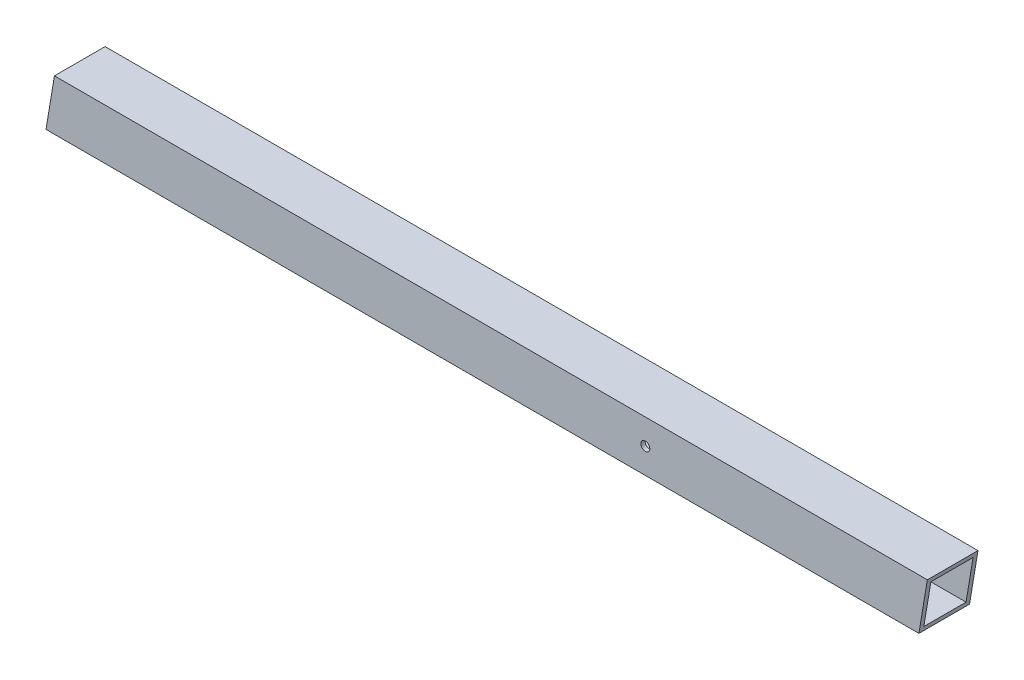
ISO-10303-21;
HEADER;
FILE_DESCRIPTION(('STEP AP214'),'2;1');
FILE_NAME('part.step','',(''),(''),'','','');
FILE_SCHEMA(('AUTOMOTIVE_DESIGN { 1 0 10303 214 1 1 1 1 }'));
ENDSEC;
DATA;
#1=APPLICATION_CONTEXT('core data for automotive mechanical design processes');
#2=APPLICATION_PROTOCOL_DEFINITION('international standard','automotive_design',2000,#1);
#3=PRODUCT_CONTEXT('',#1,'mechanical');
#4=PRODUCT('Part','Part','',(#3));
#5=PRODUCT_RELATED_PRODUCT_CATEGORY('part','',(#4));
#6=PRODUCT_DEFINITION_FORMATION('','',#4);
#7=PRODUCT_DEFINITION_CONTEXT('part definition',#1,'design');
#8=PRODUCT_DEFINITION('design','',#6,#7);
#9=PRODUCT_DEFINITION_SHAPE('','',#8);
#10=(LENGTH_UNIT() NAMED_UNIT(*) SI_UNIT(.MILLI.,.METRE.));
#11=(NAMED_UNIT(*) PLANE_ANGLE_UNIT() SI_UNIT($,.RADIAN.));
#12=(NAMED_UNIT(*) SI_UNIT($,.STERADIAN.) SOLID_ANGLE_UNIT());
#13=UNCERTAINTY_MEASURE_WITH_UNIT(LENGTH_MEASURE(1.E-05),#10,'distance_accuracy_value','');
#14=(GEOMETRIC_REPRESENTATION_CONTEXT(3) GLOBAL_UNCERTAINTY_ASSIGNED_CONTEXT((#13)) GLOBAL_UNIT_ASSIGNED_CONTEXT((#10,
#11,#12)) REPRESENTATION_CONTEXT('',''));
#15=CARTESIAN_POINT('',(0.,0.,0.));
#16=DIRECTION('',(0.,0.,1.));
#17=DIRECTION('',(1.,0.,0.));
#18=AXIS2_PLACEMENT_3D('',#15,#16,#17);
#19=CARTESIAN_POINT('',(6.26360141633399,38.0999999999999,-38.1));
#20=DIRECTION('',(0.,-1.,0.));
#21=DIRECTION('',(1.,0.,0.));
#22=AXIS2_PLACEMENT_3D('',#19,#20,#21);
#23=PLANE('',#22);
#24=DIRECTION('',(0.,0.,1.));
#25=VECTOR('',#24,1.);
#26=CARTESIAN_POINT('',(-32.3619406510596,38.0999999999999,-38.1));
#27=LINE('',#26,#25);
#28=CARTESIAN_POINT('',(-32.3619406510596,38.0999999999999,-38.1));
#29=VERTEX_POINT('',#28);
#30=CARTESIAN_POINT('',(-32.3619406510596,38.0999999999999,0.));
#31=VERTEX_POINT('',#30);
#32=EDGE_CURVE('E99',#29,#31,#27,.T.);
#33=ORIENTED_EDGE('',*,*,#32,.F.);
#34=DIRECTION('',(-1.,0.,0.));
#35=VECTOR('',#34,1.);
#36=CARTESIAN_POINT('',(6.26360141633399,38.0999999999999,-38.1));
#37=LINE('',#36,#35);
#38=CARTESIAN_POINT('',(-688.996155796752,38.1,-38.1));
#39=VERTEX_POINT('',#38);
#40=EDGE_CURVE('E122',#29,#39,#37,.T.);
#41=ORIENTED_EDGE('',*,*,#40,.T.);
#42=DIRECTION('',(0.,0.,-1.));
#43=VECTOR('',#42,1.);
#44=CARTESIAN_POINT('',(-688.996155796752,38.1,-38.1));
#45=LINE('',#44,#43);
#46=CARTESIAN_POINT('',(-688.996155796752,38.1,0.));
#47=VERTEX_POINT('',#46);
#48=EDGE_CURVE('E141',#47,#39,#45,.T.);
#49=ORIENTED_EDGE('',*,*,#48,.F.);
#50=DIRECTION('',(-1.,0.,0.));
#51=VECTOR('',#50,1.);
#52=CARTESIAN_POINT('',(6.26360141633399,38.0999999999999,0.));
#53=LINE('',#52,#51);
#54=EDGE_CURVE('E118',#31,#47,#53,.T.);
#55=ORIENTED_EDGE('',*,*,#54,.F.);
#56=EDGE_LOOP('',(#33,#41,#49,#55));
#57=FACE_BOUND('',#56,.T.);
#58=ADVANCED_FACE('F33',(#57),#23,.F.);
#59=CARTESIAN_POINT('',(6.26360141633409,0.,0.));
#60=DIRECTION('',(0.,0.,-1.));
#61=DIRECTION('',(-0.986393923832144,0.164398987305357,0.));
#62=AXIS2_PLACEMENT_3D('',#59,#60,#61);
#63=PLANE('',#62);
#64=CARTESIAN_POINT('',(-244.496155796752,19.0499999999999,0.));
#65=DIRECTION('',(0.,0.,1.));
#66=DIRECTION('',(0.986393923832144,-0.164398987305357,0.));
#67=AXIS2_PLACEMENT_3D('',#64,#65,#66);
#68=CIRCLE('',#67,3.3782);
#69=CARTESIAN_POINT('',(-241.163919843263,18.4946273410849,0.));
#70=VERTEX_POINT('',#69);
#71=EDGE_CURVE('E191',#70,#70,#68,.T.);
#72=ORIENTED_EDGE('',*,*,#71,.F.);
#73=EDGE_LOOP('',(#72));
#74=FACE_BOUND('',#73,.T.);
#75=DIRECTION('',(0.164398987305357,0.986393923832144,0.));
#76=VECTOR('',#75,1.);
#77=CARTESIAN_POINT('',(-149.28250042263,-663.423358629421,0.));
#78=LINE('',#77,#76);
#79=CARTESIAN_POINT('',(-38.7119406510596,-1.11022302462516E-13,0.));
#80=VERTEX_POINT('',#79);
#81=EDGE_CURVE('E95',#80,#31,#78,.T.);
#82=ORIENTED_EDGE('',*,*,#81,.T.);
#83=ORIENTED_EDGE('',*,*,#54,.T.);
#84=DIRECTION('',(-0.164398987305357,-0.986393923832144,0.));
#85=VECTOR('',#84,1.);
#86=CARTESIAN_POINT('',(-690.040089366142,31.8363985836658,0.));
#87=LINE('',#86,#85);
#88=CARTESIAN_POINT('',(-695.346155796752,0.,0.));
#89=VERTEX_POINT('',#88);
#90=EDGE_CURVE('E117',#47,#89,#87,.T.);
#91=ORIENTED_EDGE('',*,*,#90,.T.);
#92=DIRECTION('',(-1.,0.,0.));
#93=VECTOR('',#92,1.);
#94=CARTESIAN_POINT('',(6.26360141633409,0.,0.));
#95=LINE('',#94,#93);
#96=EDGE_CURVE('E109',#80,#89,#95,.T.);
#97=ORIENTED_EDGE('',*,*,#96,.F.);
#98=EDGE_LOOP('',(#82,#83,#91,#97));
#99=FACE_BOUND('',#98,.T.);
#100=ADVANCED_FACE('F115',(#74,#99),#63,.F.);
#101=CARTESIAN_POINT('',(6.26360141633409,0.,-38.1));
#102=DIRECTION('',(0.,1.,0.));
#103=DIRECTION('',(-1.,0.,0.));
#104=AXIS2_PLACEMENT_3D('',#101,#102,#103);
#105=PLANE('',#104);
#106=DIRECTION('',(0.,0.,-1.));
#107=VECTOR('',#106,1.);
#108=CARTESIAN_POINT('',(-38.7119406510596,-1.11022302462516E-13,-38.1));
#109=LINE('',#108,#107);
#110=CARTESIAN_POINT('',(-38.7119406510596,-1.11022302462516E-13,-38.1));
#111=VERTEX_POINT('',#110);
#112=EDGE_CURVE('E98',#80,#111,#109,.T.);
#113=ORIENTED_EDGE('',*,*,#112,.F.);
#114=ORIENTED_EDGE('',*,*,#96,.T.);
#115=DIRECTION('',(0.,0.,1.));
#116=VECTOR('',#115,1.);
#117=CARTESIAN_POINT('',(-695.346155796752,0.,-38.1));
#118=LINE('',#117,#116);
#119=CARTESIAN_POINT('',(-695.346155796752,0.,-38.1));
#120=VERTEX_POINT('',#119);
#121=EDGE_CURVE('E146',#120,#89,#118,.T.);
#122=ORIENTED_EDGE('',*,*,#121,.F.);
#123=DIRECTION('',(-1.,0.,0.));
#124=VECTOR('',#123,1.);
#125=CARTESIAN_POINT('',(6.26360141633409,0.,-38.1));
#126=LINE('',#125,#124);
#127=EDGE_CURVE('E111',#111,#120,#126,.T.);
#128=ORIENTED_EDGE('',*,*,#127,.F.);
#129=EDGE_LOOP('',(#113,#114,#122,#128));
#130=FACE_BOUND('',#129,.T.);
#131=ADVANCED_FACE('F107',(#130),#105,.F.);
#132=CARTESIAN_POINT('',(6.26360141633409,0.,-38.1));
#133=DIRECTION('',(0.,0.,1.));
#134=DIRECTION('',(0.986393923832144,-0.164398987305357,0.));
#135=AXIS2_PLACEMENT_3D('',#132,#133,#134);
#136=PLANE('',#135);
#137=CARTESIAN_POINT('',(-244.496155796752,19.0499999999999,-38.1));
#138=DIRECTION('',(0.,0.,1.));
#139=DIRECTION('',(0.986393923832144,-0.164398987305357,0.));
#140=AXIS2_PLACEMENT_3D('',#137,#138,#139);
#141=CIRCLE('',#140,3.3782);
#142=CARTESIAN_POINT('',(-241.163919843263,18.4946273410849,-38.1));
#143=VERTEX_POINT('',#142);
#144=EDGE_CURVE('E188',#143,#143,#141,.T.);
#145=ORIENTED_EDGE('',*,*,#144,.T.);
#146=EDGE_LOOP('',(#145));
#147=FACE_BOUND('',#146,.T.);
#148=DIRECTION('',(0.164398987305357,0.986393923832144,0.));
#149=VECTOR('',#148,1.);
#150=CARTESIAN_POINT('',(-149.28250042263,-663.423358629421,-38.1));
#151=LINE('',#150,#149);
#152=EDGE_CURVE('E48',#111,#29,#151,.T.);
#153=ORIENTED_EDGE('',*,*,#152,.F.);
#154=ORIENTED_EDGE('',*,*,#127,.T.);
#155=DIRECTION('',(-0.164398987305357,-0.986393923832144,0.));
#156=VECTOR('',#155,1.);
#157=CARTESIAN_POINT('',(-690.040089366142,31.8363985836658,-38.1));
#158=LINE('',#157,#156);
#159=EDGE_CURVE('E112',#39,#120,#158,.T.);
#160=ORIENTED_EDGE('',*,*,#159,.F.);
#161=ORIENTED_EDGE('',*,*,#40,.F.);
#162=EDGE_LOOP('',(#153,#154,#160,#161));
#163=FACE_BOUND('',#162,.T.);
#164=ADVANCED_FACE('F183',(#147,#163),#136,.F.);
#165=CARTESIAN_POINT('',(-690.040089366142,31.8363985836658,-38.1));
#166=DIRECTION('',(-0.986393923832144,0.164398987305357,0.));
#167=DIRECTION('',(0.,0.,1.));
#168=AXIS2_PLACEMENT_3D('',#165,#166,#167);
#169=PLANE('',#168);
#170=DIRECTION('',(0.164398987305357,0.986393923832144,0.));
#171=VECTOR('',#170,1.);
#172=CARTESIAN_POINT('',(-675.868865061264,116.863744412933,-3.175));
#173=LINE('',#172,#171);
#174=CARTESIAN_POINT('',(-694.816989130086,3.17499999999993,-3.17499999999999));
#175=VERTEX_POINT('',#174);
#176=CARTESIAN_POINT('',(-689.525322463419,34.9250000000001,-3.17499999999999));
#177=VERTEX_POINT('',#176);
#178=EDGE_CURVE('E41',#175,#177,#173,.T.);
#179=ORIENTED_EDGE('',*,*,#178,.F.);
#180=DIRECTION('',(0.,0.,1.));
#181=VECTOR('',#180,1.);
#182=CARTESIAN_POINT('',(-694.816989130086,3.17499999999993,-34.925));
#183=LINE('',#182,#181);
#184=CARTESIAN_POINT('',(-694.816989130086,3.17499999999993,-34.925));
#185=VERTEX_POINT('',#184);
#186=EDGE_CURVE('E164',#185,#175,#183,.T.);
#187=ORIENTED_EDGE('',*,*,#186,.F.);
#188=DIRECTION('',(-0.164398987305357,-0.986393923832144,0.));
#189=VECTOR('',#188,1.);
#190=CARTESIAN_POINT('',(-675.868865061264,116.863744412933,-34.925));
#191=LINE('',#190,#189);
#192=CARTESIAN_POINT('',(-689.525322463419,34.9250000000001,-34.925));
#193=VERTEX_POINT('',#192);
#194=EDGE_CURVE('E168',#193,#185,#191,.T.);
#195=ORIENTED_EDGE('',*,*,#194,.F.);
#196=DIRECTION('',(0.,0.,-1.));
#197=VECTOR('',#196,1.);
#198=CARTESIAN_POINT('',(-689.525322463419,34.9250000000001,-34.925));
#199=LINE('',#198,#197);
#200=EDGE_CURVE('E151',#177,#193,#199,.T.);
#201=ORIENTED_EDGE('',*,*,#200,.F.);
#202=EDGE_LOOP('',(#179,#187,#195,#201));
#203=FACE_BOUND('',#202,.T.);
#204=ORIENTED_EDGE('',*,*,#48,.T.);
#205=ORIENTED_EDGE('',*,*,#159,.T.);
#206=ORIENTED_EDGE('',*,*,#121,.T.);
#207=ORIENTED_EDGE('',*,*,#90,.F.);
#208=EDGE_LOOP('',(#204,#205,#206,#207));
#209=FACE_BOUND('',#208,.T.);
#210=ADVANCED_FACE('F163',(#203,#209),#169,.T.);
#211=CARTESIAN_POINT('',(6.26360141633402,34.9249999999999,-34.925));
#212=DIRECTION('',(0.,-1.,0.));
#213=DIRECTION('',(1.,0.,0.));
#214=AXIS2_PLACEMENT_3D('',#211,#212,#213);
#215=PLANE('',#214);
#216=DIRECTION('',(-1.,0.,0.));
#217=VECTOR('',#216,1.);
#218=CARTESIAN_POINT('',(6.26360141633402,34.9249999999999,-34.925));
#219=LINE('',#218,#217);
#220=CARTESIAN_POINT('',(-32.8911073177263,34.925,-34.925));
#221=VERTEX_POINT('',#220);
#222=EDGE_CURVE('E127',#221,#193,#219,.T.);
#223=ORIENTED_EDGE('',*,*,#222,.F.);
#224=DIRECTION('',(0.,0.,1.));
#225=VECTOR('',#224,1.);
#226=CARTESIAN_POINT('',(-32.8911073177263,34.925,-34.925));
#227=LINE('',#226,#225);
#228=CARTESIAN_POINT('',(-32.8911073177263,34.925,-3.175));
#229=VERTEX_POINT('',#228);
#230=EDGE_CURVE('E11',#221,#229,#227,.T.);
#231=ORIENTED_EDGE('',*,*,#230,.T.);
#232=DIRECTION('',(-1.,0.,0.));
#233=VECTOR('',#232,1.);
#234=CARTESIAN_POINT('',(6.26360141633402,34.9249999999999,-3.175));
#235=LINE('',#234,#233);
#236=EDGE_CURVE('E120',#229,#177,#235,.T.);
#237=ORIENTED_EDGE('',*,*,#236,.T.);
#238=ORIENTED_EDGE('',*,*,#200,.T.);
#239=EDGE_LOOP('',(#223,#231,#237,#238));
#240=FACE_BOUND('',#239,.T.);
#241=ADVANCED_FACE('F174',(#240),#215,.T.);
#242=CARTESIAN_POINT('',(6.26360141633407,3.17500000000004,-34.925));
#243=DIRECTION('',(0.,0.,1.));
#244=DIRECTION('',(0.986393923832144,-0.164398987305357,0.));
#245=AXIS2_PLACEMENT_3D('',#242,#243,#244);
#246=PLANE('',#245);
#247=CARTESIAN_POINT('',(-244.496155796752,19.0499999999999,-34.925));
#248=DIRECTION('',(0.,0.,1.));
#249=DIRECTION('',(0.986393923832144,-0.164398987305357,0.));
#250=AXIS2_PLACEMENT_3D('',#247,#248,#249);
#251=CIRCLE('',#250,3.3782);
#252=CARTESIAN_POINT('',(-241.163919843263,18.4946273410849,-34.925));
#253=VERTEX_POINT('',#252);
#254=EDGE_CURVE('E184',#253,#253,#251,.T.);
#255=ORIENTED_EDGE('',*,*,#254,.F.);
#256=EDGE_LOOP('',(#255));
#257=FACE_BOUND('',#256,.T.);
#258=DIRECTION('',(-1.,0.,0.));
#259=VECTOR('',#258,1.);
#260=CARTESIAN_POINT('',(6.26360141633407,3.17500000000004,-34.925));
#261=LINE('',#260,#259);
#262=CARTESIAN_POINT('',(-38.1827739843929,3.17499999999993,-34.925));
#263=VERTEX_POINT('',#262);
#264=EDGE_CURVE('E131',#263,#185,#261,.T.);
#265=ORIENTED_EDGE('',*,*,#264,.F.);
#266=DIRECTION('',(0.164398987305357,0.986393923832144,0.));
#267=VECTOR('',#266,1.);
#268=CARTESIAN_POINT('',(-36.9815205951841,10.382520335253,-34.925));
#269=LINE('',#268,#267);
#270=EDGE_CURVE('E103',#263,#221,#269,.T.);
#271=ORIENTED_EDGE('',*,*,#270,.T.);
#272=ORIENTED_EDGE('',*,*,#222,.T.);
#273=ORIENTED_EDGE('',*,*,#194,.T.);
#274=EDGE_LOOP('',(#265,#271,#272,#273));
#275=FACE_BOUND('',#274,.T.);
#276=ADVANCED_FACE('F175',(#257,#275),#246,.T.);
#277=CARTESIAN_POINT('',(6.26360141633407,3.17500000000004,-34.925));
#278=DIRECTION('',(0.,1.,0.));
#279=DIRECTION('',(-1.,0.,0.));
#280=AXIS2_PLACEMENT_3D('',#277,#278,#279);
#281=PLANE('',#280);
#282=DIRECTION('',(-1.,0.,0.));
#283=VECTOR('',#282,1.);
#284=CARTESIAN_POINT('',(6.26360141633407,3.17500000000004,-3.175));
#285=LINE('',#284,#283);
#286=CARTESIAN_POINT('',(-38.1827739843929,3.17499999999993,-3.17499999999999));
#287=VERTEX_POINT('',#286);
#288=EDGE_CURVE('E138',#287,#175,#285,.T.);
#289=ORIENTED_EDGE('',*,*,#288,.F.);
#290=DIRECTION('',(0.,0.,-1.));
#291=VECTOR('',#290,1.);
#292=CARTESIAN_POINT('',(-38.1827739843929,3.17499999999993,-34.925));
#293=LINE('',#292,#291);
#294=EDGE_CURVE('E176',#287,#263,#293,.T.);
#295=ORIENTED_EDGE('',*,*,#294,.T.);
#296=ORIENTED_EDGE('',*,*,#264,.T.);
#297=ORIENTED_EDGE('',*,*,#186,.T.);
#298=EDGE_LOOP('',(#289,#295,#296,#297));
#299=FACE_BOUND('',#298,.T.);
#300=ADVANCED_FACE('F166',(#299),#281,.T.);
#301=CARTESIAN_POINT('',(6.26360141633407,3.17500000000004,-3.175));
#302=DIRECTION('',(0.,0.,-1.));
#303=DIRECTION('',(-0.986393923832144,0.164398987305357,0.));
#304=AXIS2_PLACEMENT_3D('',#301,#302,#303);
#305=PLANE('',#304);
#306=CARTESIAN_POINT('',(-244.496155796752,19.0499999999999,-3.17499999999999));
#307=DIRECTION('',(0.,0.,-1.));
#308=DIRECTION('',(-0.986393923832144,0.164398987305357,0.));
#309=AXIS2_PLACEMENT_3D('',#306,#307,#308);
#310=CIRCLE('',#309,3.3782);
#311=CARTESIAN_POINT('',(-247.828391750242,19.6053726589149,-3.17499999999999));
#312=VERTEX_POINT('',#311);
#313=EDGE_CURVE('E36',#312,#312,#310,.T.);
#314=ORIENTED_EDGE('',*,*,#313,.F.);
#315=EDGE_LOOP('',(#314));
#316=FACE_BOUND('',#315,.T.);
#317=ORIENTED_EDGE('',*,*,#236,.F.);
#318=DIRECTION('',(-0.164398987305357,-0.986393923832144,0.));
#319=VECTOR('',#318,1.);
#320=CARTESIAN_POINT('',(-36.9815205951841,10.382520335253,-3.175));
#321=LINE('',#320,#319);
#322=EDGE_CURVE('E56',#229,#287,#321,.T.);
#323=ORIENTED_EDGE('',*,*,#322,.T.);
#324=ORIENTED_EDGE('',*,*,#288,.T.);
#325=ORIENTED_EDGE('',*,*,#178,.T.);
#326=EDGE_LOOP('',(#317,#323,#324,#325));
#327=FACE_BOUND('',#326,.T.);
#328=ADVANCED_FACE('F156',(#316,#327),#305,.T.);
#329=CARTESIAN_POINT('',(-149.28250042263,-663.423358629421,-38.1));
#330=DIRECTION('',(0.986393923832144,-0.164398987305357,0.));
#331=DIRECTION('',(0.164398987305357,0.986393923832144,0.));
#332=AXIS2_PLACEMENT_3D('',#329,#330,#331);
#333=PLANE('',#332);
#334=ORIENTED_EDGE('',*,*,#230,.F.);
#335=ORIENTED_EDGE('',*,*,#270,.F.);
#336=ORIENTED_EDGE('',*,*,#294,.F.);
#337=ORIENTED_EDGE('',*,*,#322,.F.);
#338=EDGE_LOOP('',(#334,#335,#336,#337));
#339=FACE_BOUND('',#338,.T.);
#340=ORIENTED_EDGE('',*,*,#112,.T.);
#341=ORIENTED_EDGE('',*,*,#152,.T.);
#342=ORIENTED_EDGE('',*,*,#32,.T.);
#343=ORIENTED_EDGE('',*,*,#81,.F.);
#344=EDGE_LOOP('',(#340,#341,#342,#343));
#345=FACE_BOUND('',#344,.T.);
#346=ADVANCED_FACE('F97',(#339,#345),#333,.T.);
#347=CARTESIAN_POINT('',(-244.496155796752,19.0499999999999,0.));
#348=DIRECTION('',(0.,0.,1.));
#349=DIRECTION('',(0.986393923832144,-0.164398987305357,0.));
#350=AXIS2_PLACEMENT_3D('',#347,#348,#349);
#351=CYLINDRICAL_SURFACE('',#350,3.3782);
#352=ORIENTED_EDGE('',*,*,#313,.T.);
#353=EDGE_LOOP('',(#352));
#354=FACE_BOUND('',#353,.T.);
#355=ORIENTED_EDGE('',*,*,#71,.T.);
#356=EDGE_LOOP('',(#355));
#357=FACE_BOUND('',#356,.T.);
#358=ADVANCED_FACE('F195',(#354,#357),#351,.F.);
#359=ORIENTED_EDGE('',*,*,#254,.T.);
#360=EDGE_LOOP('',(#359));
#361=FACE_BOUND('',#360,.T.);
#362=ORIENTED_EDGE('',*,*,#144,.F.);
#363=EDGE_LOOP('',(#362));
#364=FACE_BOUND('',#363,.T.);
#365=ADVANCED_FACE('F222',(#361,#364),#351,.F.);
#366=CLOSED_SHELL('',(#58,#100,#131,#164,#210,#241,#276,#300,#328,#346,#358,#365));
#367=MANIFOLD_SOLID_BREP('B2',#366);
#368=ADVANCED_BREP_SHAPE_REPRESENTATION('',(#18,#367),#14);
#369=SHAPE_DEFINITION_REPRESENTATION(#9,#368);
ENDSEC;
END-ISO-10303-21;
